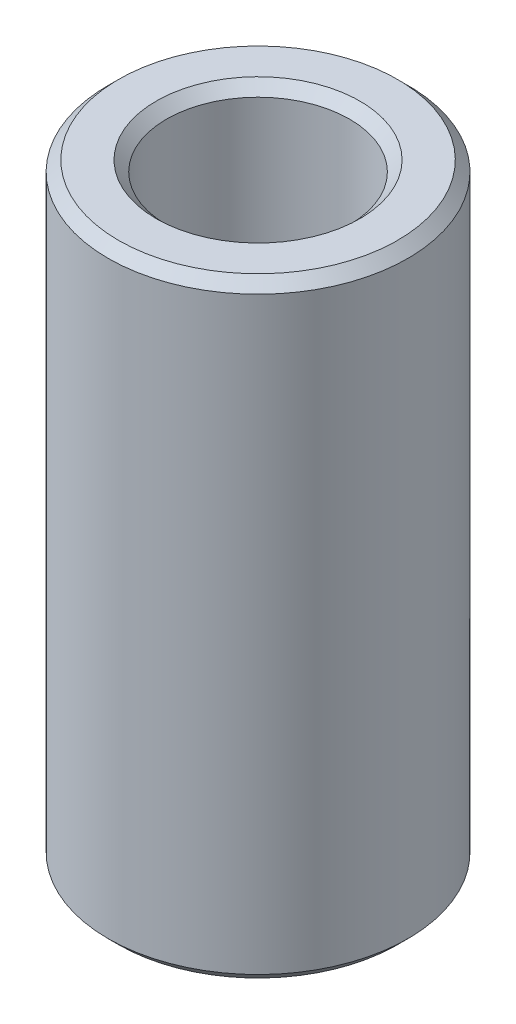
ISO-10303-21;
HEADER;
FILE_DESCRIPTION(('STEP AP214'),'2;1');
FILE_NAME('part.step','',(''),(''),'','','');
FILE_SCHEMA(('AUTOMOTIVE_DESIGN { 1 0 10303 214 1 1 1 1 }'));
ENDSEC;
DATA;
#1=APPLICATION_CONTEXT('core data for automotive mechanical design processes');
#2=APPLICATION_PROTOCOL_DEFINITION('international standard','automotive_design',2000,#1);
#3=PRODUCT_CONTEXT('',#1,'mechanical');
#4=PRODUCT('Part','Part','',(#3));
#5=PRODUCT_RELATED_PRODUCT_CATEGORY('part','',(#4));
#6=PRODUCT_DEFINITION_FORMATION('','',#4);
#7=PRODUCT_DEFINITION_CONTEXT('part definition',#1,'design');
#8=PRODUCT_DEFINITION('design','',#6,#7);
#9=PRODUCT_DEFINITION_SHAPE('','',#8);
#10=(LENGTH_UNIT() NAMED_UNIT(*) SI_UNIT(.MILLI.,.METRE.));
#11=(NAMED_UNIT(*) PLANE_ANGLE_UNIT() SI_UNIT($,.RADIAN.));
#12=(NAMED_UNIT(*) SI_UNIT($,.STERADIAN.) SOLID_ANGLE_UNIT());
#13=UNCERTAINTY_MEASURE_WITH_UNIT(LENGTH_MEASURE(1.E-05),#10,'distance_accuracy_value','');
#14=(GEOMETRIC_REPRESENTATION_CONTEXT(3) GLOBAL_UNCERTAINTY_ASSIGNED_CONTEXT((#13)) GLOBAL_UNIT_ASSIGNED_CONTEXT((#10,
#11,#12)) REPRESENTATION_CONTEXT('',''));
#15=CARTESIAN_POINT('',(0.,0.,0.));
#16=DIRECTION('',(0.,0.,1.));
#17=DIRECTION('',(1.,0.,0.));
#18=AXIS2_PLACEMENT_3D('',#15,#16,#17);
#19=CARTESIAN_POINT('',(0.,30.5232117524942,0.));
#20=DIRECTION('',(0.,-1.,0.));
#21=DIRECTION('',(0.,0.,-1.));
#22=AXIS2_PLACEMENT_3D('',#19,#20,#21);
#23=CYLINDRICAL_SURFACE('',#22,7.5);
#24=CARTESIAN_POINT('',(0.,0.519848847431507,0.));
#25=DIRECTION('',(0.,1.,0.));
#26=DIRECTION('',(0.,0.,1.));
#27=AXIS2_PLACEMENT_3D('',#24,#25,#26);
#28=CIRCLE('',#27,7.5);
#29=CARTESIAN_POINT('',(0.,0.519848847431507,7.5));
#30=VERTEX_POINT('',#29);
#31=EDGE_CURVE('E10',#30,#30,#28,.T.);
#32=ORIENTED_EDGE('',*,*,#31,.T.);
#33=EDGE_LOOP('',(#32));
#34=FACE_BOUND('',#33,.T.);
#35=CARTESIAN_POINT('',(0.,30.0033629050627,0.));
#36=DIRECTION('',(0.,1.,0.));
#37=DIRECTION('',(0.,0.,1.));
#38=AXIS2_PLACEMENT_3D('',#35,#36,#37);
#39=CIRCLE('',#38,7.5);
#40=CARTESIAN_POINT('',(0.,30.0033629050627,7.5));
#41=VERTEX_POINT('',#40);
#42=EDGE_CURVE('E50',#41,#41,#39,.F.);
#43=ORIENTED_EDGE('',*,*,#42,.T.);
#44=EDGE_LOOP('',(#43));
#45=FACE_BOUND('',#44,.T.);
#46=ADVANCED_FACE('F39',(#34,#45),#23,.T.);
#47=CARTESIAN_POINT('',(0.,30.5232117524942,0.));
#48=DIRECTION('',(0.,1.,0.));
#49=DIRECTION('',(0.,0.,1.));
#50=AXIS2_PLACEMENT_3D('',#47,#48,#49);
#51=PLANE('',#50);
#52=CARTESIAN_POINT('',(0.,30.5232117524942,0.));
#53=DIRECTION('',(0.,1.,0.));
#54=DIRECTION('',(0.,0.,1.));
#55=AXIS2_PLACEMENT_3D('',#52,#53,#54);
#56=CIRCLE('',#55,5.09794116994171);
#57=CARTESIAN_POINT('',(0.,30.5232117524942,5.09794116994171));
#58=VERTEX_POINT('',#57);
#59=EDGE_CURVE('E58',#58,#58,#56,.F.);
#60=ORIENTED_EDGE('',*,*,#59,.T.);
#61=EDGE_LOOP('',(#60));
#62=FACE_BOUND('',#61,.T.);
#63=CARTESIAN_POINT('',(0.,30.5232117524942,0.));
#64=DIRECTION('',(0.,1.,0.));
#65=DIRECTION('',(0.,0.,1.));
#66=AXIS2_PLACEMENT_3D('',#63,#64,#65);
#67=CIRCLE('',#66,6.98015115256849);
#68=CARTESIAN_POINT('',(0.,30.5232117524942,6.98015115256849));
#69=VERTEX_POINT('',#68);
#70=EDGE_CURVE('E61',#69,#69,#67,.T.);
#71=ORIENTED_EDGE('',*,*,#70,.T.);
#72=EDGE_LOOP('',(#71));
#73=FACE_BOUND('',#72,.T.);
#74=ADVANCED_FACE('F88',(#62,#73),#51,.T.);
#75=CARTESIAN_POINT('',(0.,0.,0.));
#76=DIRECTION('',(0.,1.,0.));
#77=DIRECTION('',(0.,0.,1.));
#78=AXIS2_PLACEMENT_3D('',#75,#76,#77);
#79=PLANE('',#78);
#80=CARTESIAN_POINT('',(0.,0.,0.));
#81=DIRECTION('',(0.,1.,0.));
#82=DIRECTION('',(0.,0.,1.));
#83=AXIS2_PLACEMENT_3D('',#80,#81,#82);
#84=CIRCLE('',#83,5.09794116994169);
#85=CARTESIAN_POINT('',(0.,0.,5.09794116994169));
#86=VERTEX_POINT('',#85);
#87=EDGE_CURVE('E51',#86,#86,#84,.T.);
#88=ORIENTED_EDGE('',*,*,#87,.T.);
#89=EDGE_LOOP('',(#88));
#90=FACE_BOUND('',#89,.T.);
#91=CARTESIAN_POINT('',(0.,0.,0.));
#92=DIRECTION('',(0.,1.,0.));
#93=DIRECTION('',(0.,0.,1.));
#94=AXIS2_PLACEMENT_3D('',#91,#92,#93);
#95=CIRCLE('',#94,6.98015115256849);
#96=CARTESIAN_POINT('',(0.,0.,6.98015115256849));
#97=VERTEX_POINT('',#96);
#98=EDGE_CURVE('E54',#97,#97,#95,.F.);
#99=ORIENTED_EDGE('',*,*,#98,.T.);
#100=EDGE_LOOP('',(#99));
#101=FACE_BOUND('',#100,.T.);
#102=ADVANCED_FACE('F83',(#90,#101),#79,.F.);
#103=CARTESIAN_POINT('',(0.,30.5232117524942,0.));
#104=DIRECTION('',(0.,-1.,0.));
#105=DIRECTION('',(0.,0.,-1.));
#106=AXIS2_PLACEMENT_3D('',#103,#104,#105);
#107=CYLINDRICAL_SURFACE('',#106,4.57809232251019);
#108=CARTESIAN_POINT('',(0.,30.0033629050627,0.));
#109=DIRECTION('',(0.,1.,0.));
#110=DIRECTION('',(0.,0.,1.));
#111=AXIS2_PLACEMENT_3D('',#108,#109,#110);
#112=CIRCLE('',#111,4.57809232251019);
#113=CARTESIAN_POINT('',(0.,30.0033629050627,4.57809232251019));
#114=VERTEX_POINT('',#113);
#115=EDGE_CURVE('E67',#114,#114,#112,.T.);
#116=ORIENTED_EDGE('',*,*,#115,.T.);
#117=EDGE_LOOP('',(#116));
#118=FACE_BOUND('',#117,.T.);
#119=CARTESIAN_POINT('',(0.,0.51984884743151,0.));
#120=DIRECTION('',(0.,1.,0.));
#121=DIRECTION('',(0.,0.,1.));
#122=AXIS2_PLACEMENT_3D('',#119,#120,#121);
#123=CIRCLE('',#122,4.57809232251019);
#124=CARTESIAN_POINT('',(0.,0.51984884743151,4.57809232251019));
#125=VERTEX_POINT('',#124);
#126=EDGE_CURVE('E69',#125,#125,#123,.F.);
#127=ORIENTED_EDGE('',*,*,#126,.T.);
#128=EDGE_LOOP('',(#127));
#129=FACE_BOUND('',#128,.T.);
#130=ADVANCED_FACE('F71',(#118,#129),#107,.F.);
#131=CARTESIAN_POINT('',(0.,30.0033629050627,0.));
#132=DIRECTION('',(0.,1.,0.));
#133=DIRECTION('',(0.,0.,1.));
#134=AXIS2_PLACEMENT_3D('',#131,#132,#133);
#135=CONICAL_SURFACE('',#134,4.57809232251019,0.785398163397457);
#136=ORIENTED_EDGE('',*,*,#59,.F.);
#137=EDGE_LOOP('',(#136));
#138=FACE_BOUND('',#137,.T.);
#139=ORIENTED_EDGE('',*,*,#115,.F.);
#140=EDGE_LOOP('',(#139));
#141=FACE_BOUND('',#140,.T.);
#142=ADVANCED_FACE('F77',(#138,#141),#135,.F.);
#143=CARTESIAN_POINT('',(0.,0.,0.));
#144=DIRECTION('',(0.,-1.,0.));
#145=DIRECTION('',(0.,0.,-1.));
#146=AXIS2_PLACEMENT_3D('',#143,#144,#145);
#147=CONICAL_SURFACE('',#146,5.09794116994169,0.785398163397444);
#148=ORIENTED_EDGE('',*,*,#126,.F.);
#149=EDGE_LOOP('',(#148));
#150=FACE_BOUND('',#149,.T.);
#151=ORIENTED_EDGE('',*,*,#87,.F.);
#152=EDGE_LOOP('',(#151));
#153=FACE_BOUND('',#152,.T.);
#154=ADVANCED_FACE('F73',(#150,#153),#147,.F.);
#155=CARTESIAN_POINT('',(0.,0.519848847431507,0.));
#156=DIRECTION('',(0.,1.,0.));
#157=DIRECTION('',(0.,0.,1.));
#158=AXIS2_PLACEMENT_3D('',#155,#156,#157);
#159=CONICAL_SURFACE('',#158,7.5,0.785398163397452);
#160=ORIENTED_EDGE('',*,*,#98,.F.);
#161=EDGE_LOOP('',(#160));
#162=FACE_BOUND('',#161,.T.);
#163=ORIENTED_EDGE('',*,*,#31,.F.);
#164=EDGE_LOOP('',(#163));
#165=FACE_BOUND('',#164,.T.);
#166=ADVANCED_FACE('F76',(#162,#165),#159,.T.);
#167=CARTESIAN_POINT('',(0.,30.5232117524942,0.));
#168=DIRECTION('',(0.,-1.,0.));
#169=DIRECTION('',(0.,0.,-1.));
#170=AXIS2_PLACEMENT_3D('',#167,#168,#169);
#171=CONICAL_SURFACE('',#170,6.98015115256849,0.785398163397445);
#172=ORIENTED_EDGE('',*,*,#42,.F.);
#173=EDGE_LOOP('',(#172));
#174=FACE_BOUND('',#173,.T.);
#175=ORIENTED_EDGE('',*,*,#70,.F.);
#176=EDGE_LOOP('',(#175));
#177=FACE_BOUND('',#176,.T.);
#178=ADVANCED_FACE('F45',(#174,#177),#171,.T.);
#179=CLOSED_SHELL('',(#46,#74,#102,#130,#142,#154,#166,#178));
#180=MANIFOLD_SOLID_BREP('B2',#179);
#181=ADVANCED_BREP_SHAPE_REPRESENTATION('',(#18,#180),#14);
#182=SHAPE_DEFINITION_REPRESENTATION(#9,#181);
ENDSEC;
END-ISO-10303-21;
